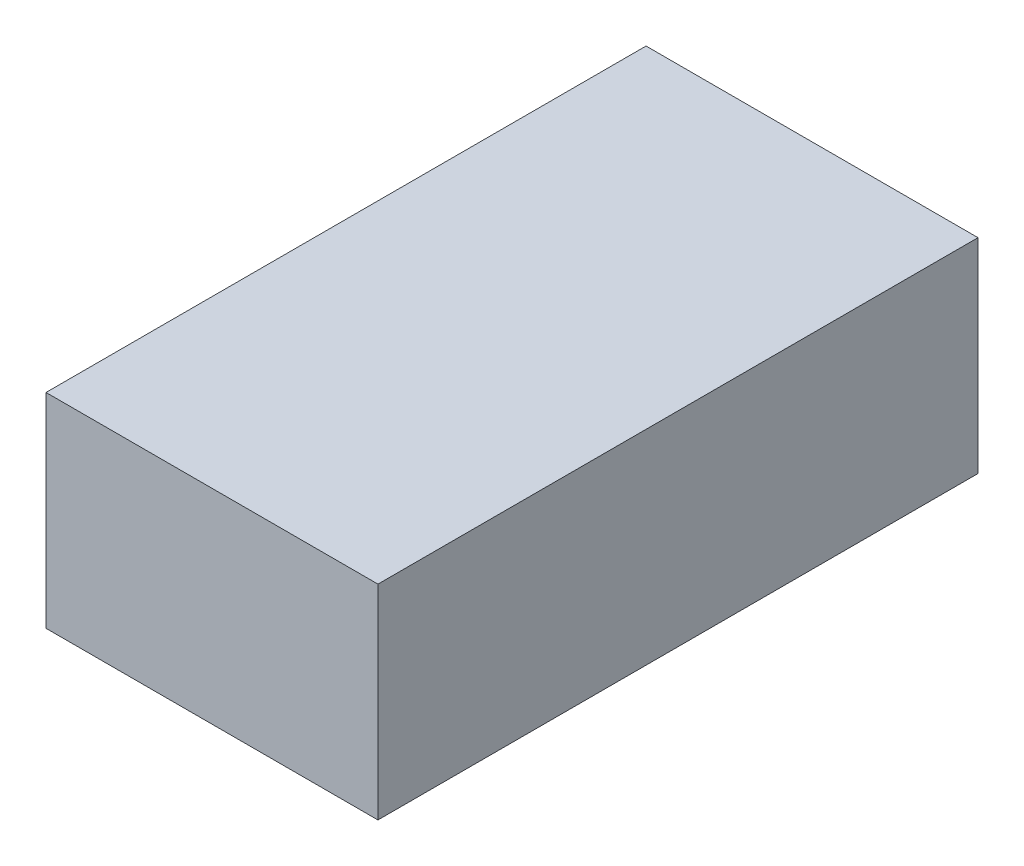
ISO-10303-21;
HEADER;
FILE_DESCRIPTION(('STEP AP214'),'2;1');
FILE_NAME('part.step','',(''),(''),'','','');
FILE_SCHEMA(('AUTOMOTIVE_DESIGN { 1 0 10303 214 1 1 1 1 }'));
ENDSEC;
DATA;
#1=APPLICATION_CONTEXT('core data for automotive mechanical design processes');
#2=APPLICATION_PROTOCOL_DEFINITION('international standard','automotive_design',2000,#1);
#3=PRODUCT_CONTEXT('',#1,'mechanical');
#4=PRODUCT('Part','Part','',(#3));
#5=PRODUCT_RELATED_PRODUCT_CATEGORY('part','',(#4));
#6=PRODUCT_DEFINITION_FORMATION('','',#4);
#7=PRODUCT_DEFINITION_CONTEXT('part definition',#1,'design');
#8=PRODUCT_DEFINITION('design','',#6,#7);
#9=PRODUCT_DEFINITION_SHAPE('','',#8);
#10=(LENGTH_UNIT() NAMED_UNIT(*) SI_UNIT(.MILLI.,.METRE.));
#11=(NAMED_UNIT(*) PLANE_ANGLE_UNIT() SI_UNIT($,.RADIAN.));
#12=(NAMED_UNIT(*) SI_UNIT($,.STERADIAN.) SOLID_ANGLE_UNIT());
#13=UNCERTAINTY_MEASURE_WITH_UNIT(LENGTH_MEASURE(1.E-05),#10,'distance_accuracy_value','');
#14=(GEOMETRIC_REPRESENTATION_CONTEXT(3) GLOBAL_UNCERTAINTY_ASSIGNED_CONTEXT((#13)) GLOBAL_UNIT_ASSIGNED_CONTEXT((#10,
#11,#12)) REPRESENTATION_CONTEXT('',''));
#15=CARTESIAN_POINT('',(0.,0.,0.));
#16=DIRECTION('',(0.,0.,1.));
#17=DIRECTION('',(1.,0.,0.));
#18=AXIS2_PLACEMENT_3D('',#15,#16,#17);
#19=CARTESIAN_POINT('',(0.,0.,47.));
#20=DIRECTION('',(1.,0.,0.));
#21=DIRECTION('',(0.,0.,-1.));
#22=AXIS2_PLACEMENT_3D('',#19,#20,#21);
#23=PLANE('',#22);
#24=DIRECTION('',(0.,-1.,0.));
#25=VECTOR('',#24,1.);
#26=CARTESIAN_POINT('',(0.,0.,0.));
#27=LINE('',#26,#25);
#28=CARTESIAN_POINT('',(0.,16.,0.));
#29=VERTEX_POINT('',#28);
#30=CARTESIAN_POINT('',(0.,0.,0.));
#31=VERTEX_POINT('',#30);
#32=EDGE_CURVE('E96',#29,#31,#27,.T.);
#33=ORIENTED_EDGE('',*,*,#32,.T.);
#34=DIRECTION('',(0.,0.,-1.));
#35=VECTOR('',#34,1.);
#36=CARTESIAN_POINT('',(0.,0.,47.));
#37=LINE('',#36,#35);
#38=CARTESIAN_POINT('',(0.,0.,47.));
#39=VERTEX_POINT('',#38);
#40=EDGE_CURVE('E11',#39,#31,#37,.T.);
#41=ORIENTED_EDGE('',*,*,#40,.F.);
#42=DIRECTION('',(0.,-1.,0.));
#43=VECTOR('',#42,1.);
#44=CARTESIAN_POINT('',(0.,0.,47.));
#45=LINE('',#44,#43);
#46=CARTESIAN_POINT('',(0.,16.,47.));
#47=VERTEX_POINT('',#46);
#48=EDGE_CURVE('E84',#47,#39,#45,.T.);
#49=ORIENTED_EDGE('',*,*,#48,.F.);
#50=DIRECTION('',(0.,0.,-1.));
#51=VECTOR('',#50,1.);
#52=CARTESIAN_POINT('',(0.,16.,47.));
#53=LINE('',#52,#51);
#54=EDGE_CURVE('E92',#47,#29,#53,.T.);
#55=ORIENTED_EDGE('',*,*,#54,.T.);
#56=EDGE_LOOP('',(#33,#41,#49,#55));
#57=FACE_BOUND('',#56,.T.);
#58=ADVANCED_FACE('F33',(#57),#23,.F.);
#59=CARTESIAN_POINT('',(0.,0.,47.));
#60=DIRECTION('',(0.,1.,0.));
#61=DIRECTION('',(0.,0.,1.));
#62=AXIS2_PLACEMENT_3D('',#59,#60,#61);
#63=PLANE('',#62);
#64=DIRECTION('',(1.,0.,0.));
#65=VECTOR('',#64,1.);
#66=CARTESIAN_POINT('',(0.,0.,0.));
#67=LINE('',#66,#65);
#68=CARTESIAN_POINT('',(26.,0.,0.));
#69=VERTEX_POINT('',#68);
#70=EDGE_CURVE('E88',#31,#69,#67,.T.);
#71=ORIENTED_EDGE('',*,*,#70,.T.);
#72=DIRECTION('',(0.,0.,-1.));
#73=VECTOR('',#72,1.);
#74=CARTESIAN_POINT('',(26.,0.,47.));
#75=LINE('',#74,#73);
#76=CARTESIAN_POINT('',(26.,0.,47.));
#77=VERTEX_POINT('',#76);
#78=EDGE_CURVE('E41',#77,#69,#75,.T.);
#79=ORIENTED_EDGE('',*,*,#78,.F.);
#80=DIRECTION('',(1.,0.,0.));
#81=VECTOR('',#80,1.);
#82=CARTESIAN_POINT('',(0.,0.,47.));
#83=LINE('',#82,#81);
#84=EDGE_CURVE('E79',#39,#77,#83,.T.);
#85=ORIENTED_EDGE('',*,*,#84,.F.);
#86=ORIENTED_EDGE('',*,*,#40,.T.);
#87=EDGE_LOOP('',(#71,#79,#85,#86));
#88=FACE_BOUND('',#87,.T.);
#89=ADVANCED_FACE('F87',(#88),#63,.F.);
#90=CARTESIAN_POINT('',(26.,0.,47.));
#91=DIRECTION('',(-1.,0.,0.));
#92=DIRECTION('',(0.,0.,1.));
#93=AXIS2_PLACEMENT_3D('',#90,#91,#92);
#94=PLANE('',#93);
#95=DIRECTION('',(0.,1.,0.));
#96=VECTOR('',#95,1.);
#97=CARTESIAN_POINT('',(26.,0.,0.));
#98=LINE('',#97,#96);
#99=CARTESIAN_POINT('',(26.,16.,0.));
#100=VERTEX_POINT('',#99);
#101=EDGE_CURVE('E66',#69,#100,#98,.T.);
#102=ORIENTED_EDGE('',*,*,#101,.T.);
#103=DIRECTION('',(0.,0.,-1.));
#104=VECTOR('',#103,1.);
#105=CARTESIAN_POINT('',(26.,16.,47.));
#106=LINE('',#105,#104);
#107=CARTESIAN_POINT('',(26.,16.,47.));
#108=VERTEX_POINT('',#107);
#109=EDGE_CURVE('E89',#108,#100,#106,.T.);
#110=ORIENTED_EDGE('',*,*,#109,.F.);
#111=DIRECTION('',(0.,1.,0.));
#112=VECTOR('',#111,1.);
#113=CARTESIAN_POINT('',(26.,0.,47.));
#114=LINE('',#113,#112);
#115=EDGE_CURVE('E82',#77,#108,#114,.T.);
#116=ORIENTED_EDGE('',*,*,#115,.F.);
#117=ORIENTED_EDGE('',*,*,#78,.T.);
#118=EDGE_LOOP('',(#102,#110,#116,#117));
#119=FACE_BOUND('',#118,.T.);
#120=ADVANCED_FACE('F90',(#119),#94,.F.);
#121=CARTESIAN_POINT('',(0.,16.,47.));
#122=DIRECTION('',(0.,-1.,0.));
#123=DIRECTION('',(0.,0.,-1.));
#124=AXIS2_PLACEMENT_3D('',#121,#122,#123);
#125=PLANE('',#124);
#126=DIRECTION('',(-1.,0.,0.));
#127=VECTOR('',#126,1.);
#128=CARTESIAN_POINT('',(0.,16.,0.));
#129=LINE('',#128,#127);
#130=EDGE_CURVE('E72',#100,#29,#129,.T.);
#131=ORIENTED_EDGE('',*,*,#130,.T.);
#132=ORIENTED_EDGE('',*,*,#54,.F.);
#133=DIRECTION('',(-1.,0.,0.));
#134=VECTOR('',#133,1.);
#135=CARTESIAN_POINT('',(0.,16.,47.));
#136=LINE('',#135,#134);
#137=EDGE_CURVE('E49',#108,#47,#136,.T.);
#138=ORIENTED_EDGE('',*,*,#137,.F.);
#139=ORIENTED_EDGE('',*,*,#109,.T.);
#140=EDGE_LOOP('',(#131,#132,#138,#139));
#141=FACE_BOUND('',#140,.T.);
#142=ADVANCED_FACE('F103',(#141),#125,.F.);
#143=CARTESIAN_POINT('',(0.,0.,47.));
#144=DIRECTION('',(0.,0.,-1.));
#145=DIRECTION('',(-1.,0.,0.));
#146=AXIS2_PLACEMENT_3D('',#143,#144,#145);
#147=PLANE('',#146);
#148=ORIENTED_EDGE('',*,*,#48,.T.);
#149=ORIENTED_EDGE('',*,*,#84,.T.);
#150=ORIENTED_EDGE('',*,*,#115,.T.);
#151=ORIENTED_EDGE('',*,*,#137,.T.);
#152=EDGE_LOOP('',(#148,#149,#150,#151));
#153=FACE_BOUND('',#152,.T.);
#154=ADVANCED_FACE('F80',(#153),#147,.F.);
#155=CARTESIAN_POINT('',(0.,0.,0.));
#156=DIRECTION('',(0.,0.,-1.));
#157=DIRECTION('',(-1.,0.,0.));
#158=AXIS2_PLACEMENT_3D('',#155,#156,#157);
#159=PLANE('',#158);
#160=ORIENTED_EDGE('',*,*,#32,.F.);
#161=ORIENTED_EDGE('',*,*,#130,.F.);
#162=ORIENTED_EDGE('',*,*,#101,.F.);
#163=ORIENTED_EDGE('',*,*,#70,.F.);
#164=EDGE_LOOP('',(#160,#161,#162,#163));
#165=FACE_BOUND('',#164,.T.);
#166=ADVANCED_FACE('F106',(#165),#159,.T.);
#167=CLOSED_SHELL('',(#58,#89,#120,#142,#154,#166));
#168=MANIFOLD_SOLID_BREP('B2',#167);
#169=ADVANCED_BREP_SHAPE_REPRESENTATION('',(#18,#168),#14);
#170=SHAPE_DEFINITION_REPRESENTATION(#9,#169);
ENDSEC;
END-ISO-10303-21;
